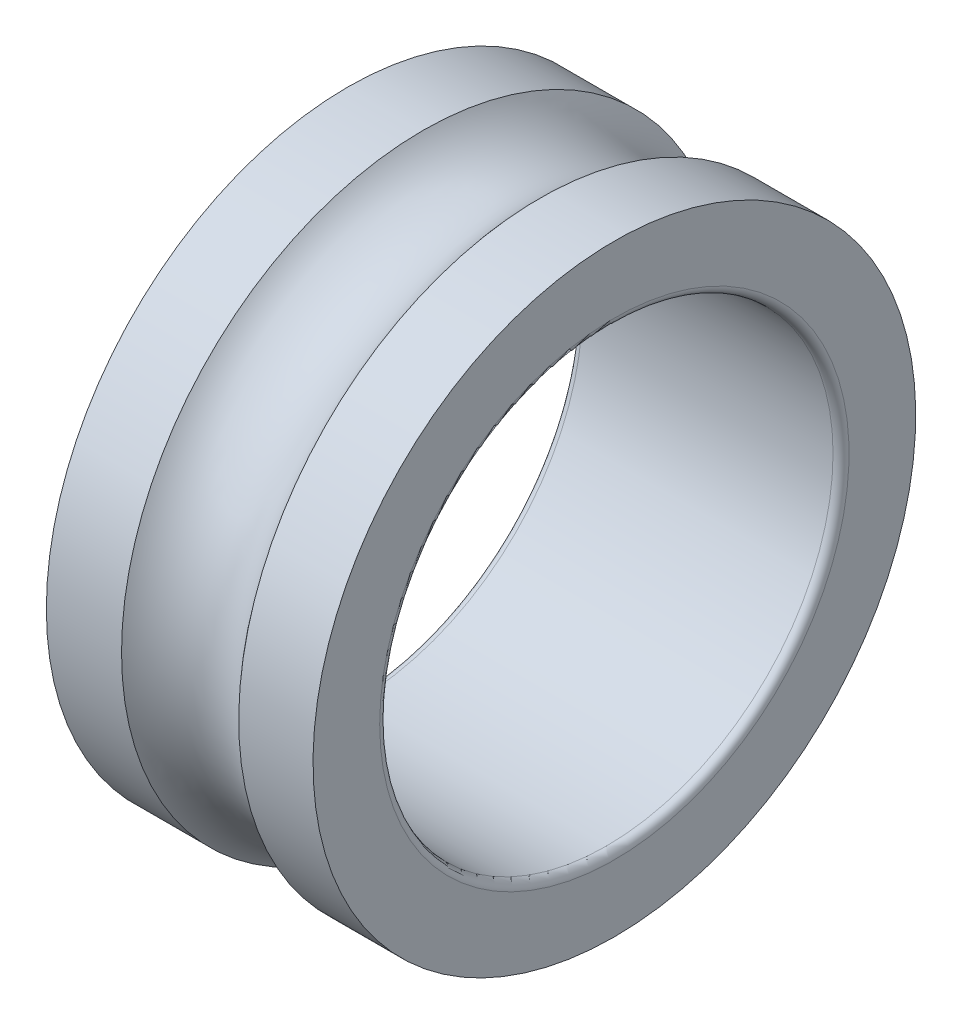
ISO-10303-21;
HEADER;
FILE_DESCRIPTION(('STEP AP214'),'2;1');
FILE_NAME('part.step','',(''),(''),'','','');
FILE_SCHEMA(('AUTOMOTIVE_DESIGN { 1 0 10303 214 1 1 1 1 }'));
ENDSEC;
DATA;
#1=APPLICATION_CONTEXT('core data for automotive mechanical design processes');
#2=APPLICATION_PROTOCOL_DEFINITION('international standard','automotive_design',2000,#1);
#3=PRODUCT_CONTEXT('',#1,'mechanical');
#4=PRODUCT('Part','Part','',(#3));
#5=PRODUCT_RELATED_PRODUCT_CATEGORY('part','',(#4));
#6=PRODUCT_DEFINITION_FORMATION('','',#4);
#7=PRODUCT_DEFINITION_CONTEXT('part definition',#1,'design');
#8=PRODUCT_DEFINITION('design','',#6,#7);
#9=PRODUCT_DEFINITION_SHAPE('','',#8);
#10=(LENGTH_UNIT() NAMED_UNIT(*) SI_UNIT(.MILLI.,.METRE.));
#11=(NAMED_UNIT(*) PLANE_ANGLE_UNIT() SI_UNIT($,.RADIAN.));
#12=(NAMED_UNIT(*) SI_UNIT($,.STERADIAN.) SOLID_ANGLE_UNIT());
#13=UNCERTAINTY_MEASURE_WITH_UNIT(LENGTH_MEASURE(1.E-05),#10,'distance_accuracy_value','');
#14=(GEOMETRIC_REPRESENTATION_CONTEXT(3) GLOBAL_UNCERTAINTY_ASSIGNED_CONTEXT((#13)) GLOBAL_UNIT_ASSIGNED_CONTEXT((#10,
#11,#12)) REPRESENTATION_CONTEXT('',''));
#15=CARTESIAN_POINT('',(0.,0.,0.));
#16=DIRECTION('',(0.,0.,1.));
#17=DIRECTION('',(1.,0.,0.));
#18=AXIS2_PLACEMENT_3D('',#15,#16,#17);
#19=CARTESIAN_POINT('',(0.,10.05,0.));
#20=DIRECTION('',(-1.,0.,0.));
#21=DIRECTION('',(0.,0.,1.));
#22=AXIS2_PLACEMENT_3D('',#19,#20,#21);
#23=PLANE('',#22);
#24=CARTESIAN_POINT('',(0.,0.,0.));
#25=DIRECTION('',(1.,0.,0.));
#26=DIRECTION('',(0.,1.,0.));
#27=AXIS2_PLACEMENT_3D('',#24,#25,#26);
#28=CIRCLE('',#27,8.8);
#29=CARTESIAN_POINT('',(0.,0.,8.8));
#30=VERTEX_POINT('',#29);
#31=EDGE_CURVE('E69',#30,#30,#28,.T.);
#32=ORIENTED_EDGE('',*,*,#31,.T.);
#33=EDGE_LOOP('',(#32));
#34=FACE_BOUND('',#33,.T.);
#35=CARTESIAN_POINT('',(0.,0.,0.));
#36=DIRECTION('',(1.,0.,0.));
#37=DIRECTION('',(0.,1.,0.));
#38=AXIS2_PLACEMENT_3D('',#35,#36,#37);
#39=CIRCLE('',#38,11.3);
#40=CARTESIAN_POINT('',(0.,-11.3,0.));
#41=VERTEX_POINT('',#40);
#42=EDGE_CURVE('E75',#41,#41,#39,.T.);
#43=ORIENTED_EDGE('',*,*,#42,.F.);
#44=EDGE_LOOP('',(#43));
#45=FACE_BOUND('',#44,.T.);
#46=ADVANCED_FACE('F17',(#34,#45),#23,.T.);
#47=CARTESIAN_POINT('',(10.,10.05,0.));
#48=DIRECTION('',(1.,0.,0.));
#49=DIRECTION('',(0.,-1.,0.));
#50=AXIS2_PLACEMENT_3D('',#47,#48,#49);
#51=PLANE('',#50);
#52=CARTESIAN_POINT('',(10.,0.,0.));
#53=DIRECTION('',(1.,0.,0.));
#54=DIRECTION('',(0.,1.,0.));
#55=AXIS2_PLACEMENT_3D('',#52,#53,#54);
#56=CIRCLE('',#55,8.8);
#57=CARTESIAN_POINT('',(10.,0.,8.8));
#58=VERTEX_POINT('',#57);
#59=EDGE_CURVE('E11',#58,#58,#56,.T.);
#60=ORIENTED_EDGE('',*,*,#59,.F.);
#61=EDGE_LOOP('',(#60));
#62=FACE_BOUND('',#61,.T.);
#63=CARTESIAN_POINT('',(10.,0.,0.));
#64=DIRECTION('',(1.,0.,0.));
#65=DIRECTION('',(0.,1.,0.));
#66=AXIS2_PLACEMENT_3D('',#63,#64,#65);
#67=CIRCLE('',#66,11.3);
#68=CARTESIAN_POINT('',(10.,-11.3,0.));
#69=VERTEX_POINT('',#68);
#70=EDGE_CURVE('E84',#69,#69,#67,.T.);
#71=ORIENTED_EDGE('',*,*,#70,.T.);
#72=EDGE_LOOP('',(#71));
#73=FACE_BOUND('',#72,.T.);
#74=ADVANCED_FACE('F96',(#62,#73),#51,.T.);
#75=CARTESIAN_POINT('',(9.7,0.,0.));
#76=DIRECTION('',(1.,0.,0.));
#77=DIRECTION('',(0.,0.,-1.));
#78=AXIS2_PLACEMENT_3D('',#75,#76,#77);
#79=TOROIDAL_SURFACE('',#78,8.8,0.3);
#80=ORIENTED_EDGE('',*,*,#59,.T.);
#81=EDGE_LOOP('',(#80));
#82=FACE_BOUND('',#81,.T.);
#83=CARTESIAN_POINT('',(9.7,0.,0.));
#84=DIRECTION('',(1.,0.,0.));
#85=DIRECTION('',(0.,1.,0.));
#86=AXIS2_PLACEMENT_3D('',#83,#84,#85);
#87=CIRCLE('',#86,8.5);
#88=CARTESIAN_POINT('',(9.7,0.,8.5));
#89=VERTEX_POINT('',#88);
#90=EDGE_CURVE('E21',#89,#89,#87,.T.);
#91=ORIENTED_EDGE('',*,*,#90,.F.);
#92=EDGE_LOOP('',(#91));
#93=FACE_BOUND('',#92,.T.);
#94=ADVANCED_FACE('F19',(#82,#93),#79,.T.);
#95=CARTESIAN_POINT('',(5.,0.,0.));
#96=DIRECTION('',(1.,0.,0.));
#97=DIRECTION('',(0.,1.,0.));
#98=AXIS2_PLACEMENT_3D('',#95,#96,#97);
#99=CYLINDRICAL_SURFACE('',#98,8.5);
#100=CARTESIAN_POINT('',(0.3,0.,0.));
#101=DIRECTION('',(1.,0.,0.));
#102=DIRECTION('',(0.,1.,0.));
#103=AXIS2_PLACEMENT_3D('',#100,#101,#102);
#104=CIRCLE('',#103,8.5);
#105=CARTESIAN_POINT('',(0.3,-8.5,0.));
#106=VERTEX_POINT('',#105);
#107=EDGE_CURVE('E64',#106,#106,#104,.T.);
#108=ORIENTED_EDGE('',*,*,#107,.F.);
#109=EDGE_LOOP('',(#108));
#110=FACE_BOUND('',#109,.T.);
#111=ORIENTED_EDGE('',*,*,#90,.T.);
#112=EDGE_LOOP('',(#111));
#113=FACE_BOUND('',#112,.T.);
#114=ADVANCED_FACE('F111',(#110,#113),#99,.F.);
#115=CARTESIAN_POINT('',(0.3,0.,0.));
#116=DIRECTION('',(1.,0.,0.));
#117=DIRECTION('',(0.,0.,-1.));
#118=AXIS2_PLACEMENT_3D('',#115,#116,#117);
#119=TOROIDAL_SURFACE('',#118,8.8,0.3);
#120=ORIENTED_EDGE('',*,*,#107,.T.);
#121=EDGE_LOOP('',(#120));
#122=FACE_BOUND('',#121,.T.);
#123=ORIENTED_EDGE('',*,*,#31,.F.);
#124=EDGE_LOOP('',(#123));
#125=FACE_BOUND('',#124,.T.);
#126=ADVANCED_FACE('F65',(#122,#125),#119,.T.);
#127=CARTESIAN_POINT('',(1.4097761995488,0.,0.));
#128=DIRECTION('',(1.,0.,0.));
#129=DIRECTION('',(0.,1.,0.));
#130=AXIS2_PLACEMENT_3D('',#127,#128,#129);
#131=CYLINDRICAL_SURFACE('',#130,11.3);
#132=ORIENTED_EDGE('',*,*,#42,.T.);
#133=EDGE_LOOP('',(#132));
#134=FACE_BOUND('',#133,.T.);
#135=CARTESIAN_POINT('',(2.8195523990976,0.,0.));
#136=DIRECTION('',(1.,0.,0.));
#137=DIRECTION('',(0.,1.,0.));
#138=AXIS2_PLACEMENT_3D('',#135,#136,#137);
#139=CIRCLE('',#138,11.3);
#140=CARTESIAN_POINT('',(2.8195523990976,11.3,0.));
#141=VERTEX_POINT('',#140);
#142=EDGE_CURVE('E79',#141,#141,#139,.T.);
#143=ORIENTED_EDGE('',*,*,#142,.F.);
#144=EDGE_LOOP('',(#143));
#145=FACE_BOUND('',#144,.T.);
#146=ADVANCED_FACE('F92',(#134,#145),#131,.T.);
#147=CARTESIAN_POINT('',(8.6068842988466,0.,0.));
#148=DIRECTION('',(1.,0.,0.));
#149=DIRECTION('',(0.,1.,0.));
#150=AXIS2_PLACEMENT_3D('',#147,#148,#149);
#151=CYLINDRICAL_SURFACE('',#150,11.3);
#152=CARTESIAN_POINT('',(7.21376859769321,0.,0.));
#153=DIRECTION('',(1.,0.,0.));
#154=DIRECTION('',(0.,1.,0.));
#155=AXIS2_PLACEMENT_3D('',#152,#153,#154);
#156=CIRCLE('',#155,11.3);
#157=CARTESIAN_POINT('',(7.21376859769321,-11.3,0.));
#158=VERTEX_POINT('',#157);
#159=EDGE_CURVE('E82',#158,#158,#156,.T.);
#160=ORIENTED_EDGE('',*,*,#159,.T.);
#161=EDGE_LOOP('',(#160));
#162=FACE_BOUND('',#161,.T.);
#163=ORIENTED_EDGE('',*,*,#70,.F.);
#164=EDGE_LOOP('',(#163));
#165=FACE_BOUND('',#164,.T.);
#166=ADVANCED_FACE('F109',(#162,#165),#151,.T.);
#167=CARTESIAN_POINT('',(5.0166604983954,0.,0.));
#168=DIRECTION('',(1.,0.,0.));
#169=DIRECTION('',(0.,0.,-1.));
#170=AXIS2_PLACEMENT_3D('',#167,#168,#169);
#171=TOROIDAL_SURFACE('',#170,13.,2.778);
#172=ORIENTED_EDGE('',*,*,#159,.F.);
#173=EDGE_LOOP('',(#172));
#174=FACE_BOUND('',#173,.T.);
#175=ORIENTED_EDGE('',*,*,#142,.T.);
#176=EDGE_LOOP('',(#175));
#177=FACE_BOUND('',#176,.T.);
#178=ADVANCED_FACE('F106',(#174,#177),#171,.F.);
#179=CLOSED_SHELL('',(#46,#74,#94,#114,#126,#146,#166,#178));
#180=MANIFOLD_SOLID_BREP('B1',#179);
#181=ADVANCED_BREP_SHAPE_REPRESENTATION('',(#18,#180),#14);
#182=SHAPE_DEFINITION_REPRESENTATION(#9,#181);
ENDSEC;
END-ISO-10303-21;
